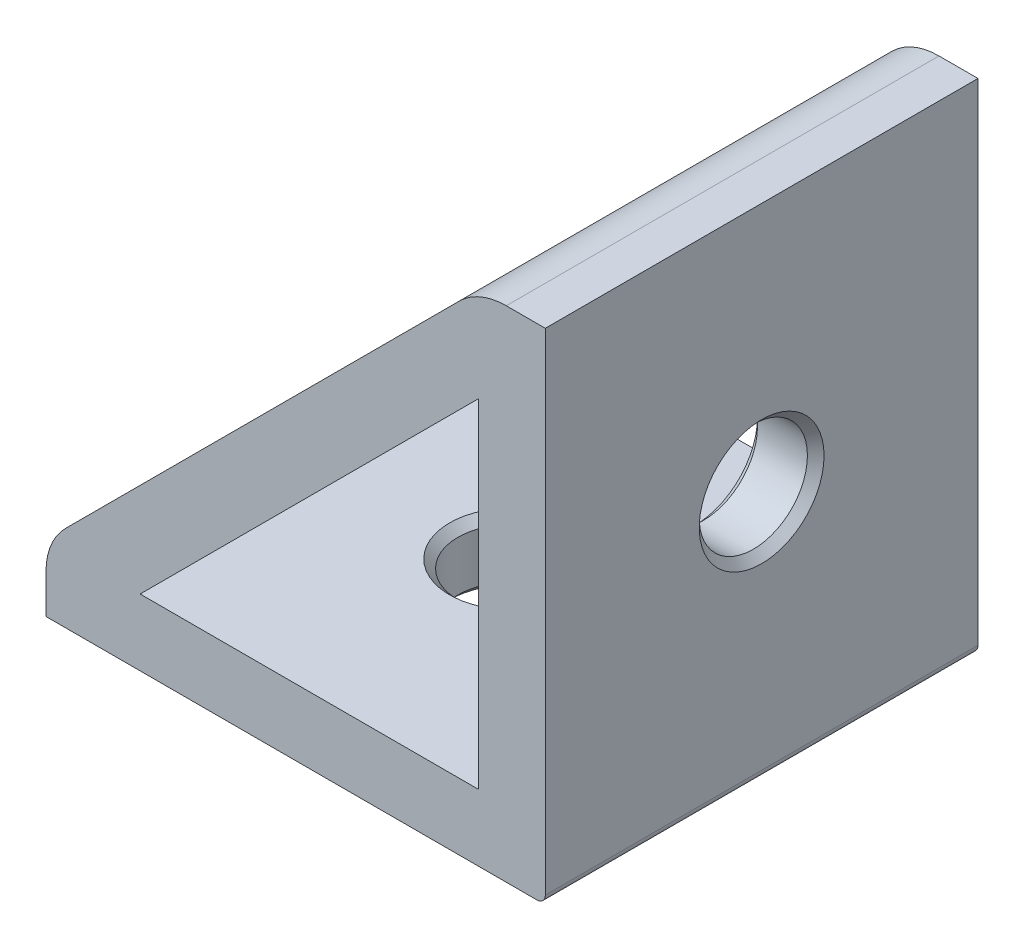
ISO-10303-21;
HEADER;
FILE_DESCRIPTION(('STEP AP214'),'2;1');
FILE_NAME('part.step','',(''),(''),'','','');
FILE_SCHEMA(('AUTOMOTIVE_DESIGN { 1 0 10303 214 1 1 1 1 }'));
ENDSEC;
DATA;
#1=APPLICATION_CONTEXT('core data for automotive mechanical design processes');
#2=APPLICATION_PROTOCOL_DEFINITION('international standard','automotive_design',2000,#1);
#3=PRODUCT_CONTEXT('',#1,'mechanical');
#4=PRODUCT('Part','Part','',(#3));
#5=PRODUCT_RELATED_PRODUCT_CATEGORY('part','',(#4));
#6=PRODUCT_DEFINITION_FORMATION('','',#4);
#7=PRODUCT_DEFINITION_CONTEXT('part definition',#1,'design');
#8=PRODUCT_DEFINITION('design','',#6,#7);
#9=PRODUCT_DEFINITION_SHAPE('','',#8);
#10=(LENGTH_UNIT() NAMED_UNIT(*) SI_UNIT(.MILLI.,.METRE.));
#11=(NAMED_UNIT(*) PLANE_ANGLE_UNIT() SI_UNIT($,.RADIAN.));
#12=(NAMED_UNIT(*) SI_UNIT($,.STERADIAN.) SOLID_ANGLE_UNIT());
#13=UNCERTAINTY_MEASURE_WITH_UNIT(LENGTH_MEASURE(1.E-05),#10,'distance_accuracy_value','');
#14=(GEOMETRIC_REPRESENTATION_CONTEXT(3) GLOBAL_UNCERTAINTY_ASSIGNED_CONTEXT((#13)) GLOBAL_UNIT_ASSIGNED_CONTEXT((#10,
#11,#12)) REPRESENTATION_CONTEXT('',''));
#15=CARTESIAN_POINT('',(0.,0.,0.));
#16=DIRECTION('',(0.,0.,1.));
#17=DIRECTION('',(1.,0.,0.));
#18=AXIS2_PLACEMENT_3D('',#15,#16,#17);
#19=CARTESIAN_POINT('',(-30.,0.,-26.));
#20=DIRECTION('',(0.,-1.,0.));
#21=DIRECTION('',(0.,0.,-1.));
#22=AXIS2_PLACEMENT_3D('',#19,#20,#21);
#23=PLANE('',#22);
#24=CARTESIAN_POINT('',(-15.,0.,-13.));
#25=DIRECTION('',(0.,-1.,0.));
#26=DIRECTION('',(0.,0.,-1.));
#27=AXIS2_PLACEMENT_3D('',#24,#25,#26);
#28=CIRCLE('',#27,3.74999999999999);
#29=CARTESIAN_POINT('',(-15.,0.,-16.75));
#30=VERTEX_POINT('',#29);
#31=EDGE_CURVE('E241',#30,#30,#28,.F.);
#32=ORIENTED_EDGE('',*,*,#31,.T.);
#33=EDGE_LOOP('',(#32));
#34=FACE_BOUND('',#33,.T.);
#35=DIRECTION('',(1.,0.,0.));
#36=VECTOR('',#35,1.);
#37=CARTESIAN_POINT('',(-30.,0.,-26.));
#38=LINE('',#37,#36);
#39=CARTESIAN_POINT('',(-30.,0.,-26.));
#40=VERTEX_POINT('',#39);
#41=CARTESIAN_POINT('',(-0.5,0.,-26.));
#42=VERTEX_POINT('',#41);
#43=EDGE_CURVE('E184',#40,#42,#38,.T.);
#44=ORIENTED_EDGE('',*,*,#43,.T.);
#45=DIRECTION('',(0.,0.,1.));
#46=VECTOR('',#45,1.);
#47=CARTESIAN_POINT('',(-0.5,0.,-26.));
#48=LINE('',#47,#46);
#49=CARTESIAN_POINT('',(-0.5,0.,0.));
#50=VERTEX_POINT('',#49);
#51=EDGE_CURVE('E303',#42,#50,#48,.T.);
#52=ORIENTED_EDGE('',*,*,#51,.T.);
#53=DIRECTION('',(1.,0.,0.));
#54=VECTOR('',#53,1.);
#55=CARTESIAN_POINT('',(-30.,0.,0.));
#56=LINE('',#55,#54);
#57=CARTESIAN_POINT('',(-30.,0.,0.));
#58=VERTEX_POINT('',#57);
#59=EDGE_CURVE('E182',#58,#50,#56,.T.);
#60=ORIENTED_EDGE('',*,*,#59,.F.);
#61=DIRECTION('',(0.,0.,1.));
#62=VECTOR('',#61,1.);
#63=CARTESIAN_POINT('',(-30.,0.,-26.));
#64=LINE('',#63,#62);
#65=EDGE_CURVE('E209',#40,#58,#64,.T.);
#66=ORIENTED_EDGE('',*,*,#65,.F.);
#67=EDGE_LOOP('',(#44,#52,#60,#66));
#68=FACE_BOUND('',#67,.T.);
#69=ADVANCED_FACE('F16',(#34,#68),#23,.T.);
#70=CARTESIAN_POINT('',(-30.,0.,-26.));
#71=DIRECTION('',(-1.,0.,0.));
#72=DIRECTION('',(0.,0.,1.));
#73=AXIS2_PLACEMENT_3D('',#70,#71,#72);
#74=PLANE('',#73);
#75=DIRECTION('',(0.,-1.,0.));
#76=VECTOR('',#75,1.);
#77=CARTESIAN_POINT('',(-30.,0.,0.));
#78=LINE('',#77,#76);
#79=CARTESIAN_POINT('',(-30.,2.34314575050762,0.));
#80=VERTEX_POINT('',#79);
#81=EDGE_CURVE('E188',#80,#58,#78,.T.);
#82=ORIENTED_EDGE('',*,*,#81,.F.);
#83=DIRECTION('',(0.,0.,1.));
#84=VECTOR('',#83,1.);
#85=CARTESIAN_POINT('',(-30.,2.34314575050762,-26.));
#86=LINE('',#85,#84);
#87=CARTESIAN_POINT('',(-30.,2.34314575050762,-26.));
#88=VERTEX_POINT('',#87);
#89=EDGE_CURVE('E230',#80,#88,#86,.F.);
#90=ORIENTED_EDGE('',*,*,#89,.T.);
#91=DIRECTION('',(0.,-1.,0.));
#92=VECTOR('',#91,1.);
#93=CARTESIAN_POINT('',(-30.,0.,-26.));
#94=LINE('',#93,#92);
#95=EDGE_CURVE('E196',#88,#40,#94,.T.);
#96=ORIENTED_EDGE('',*,*,#95,.T.);
#97=ORIENTED_EDGE('',*,*,#65,.T.);
#98=EDGE_LOOP('',(#82,#90,#96,#97));
#99=FACE_BOUND('',#98,.T.);
#100=ADVANCED_FACE('F326',(#99),#74,.T.);
#101=CARTESIAN_POINT('',(-30.,4.,-26.));
#102=DIRECTION('',(-0.707106781186548,0.707106781186548,0.));
#103=DIRECTION('',(-0.707106781186548,-0.707106781186548,0.));
#104=AXIS2_PLACEMENT_3D('',#101,#102,#103);
#105=PLANE('',#104);
#106=CARTESIAN_POINT('',(-14.8786796564404,19.1213203435596,-13.));
#107=DIRECTION('',(-0.707106781186548,0.707106781186548,0.));
#108=DIRECTION('',(-0.707106781186548,-0.707106781186548,0.));
#109=AXIS2_PLACEMENT_3D('',#106,#107,#108);
#110=CIRCLE('',#109,9.);
#111=CARTESIAN_POINT('',(-14.8786796564404,19.1213203435596,-22.));
#112=VERTEX_POINT('',#111);
#113=CARTESIAN_POINT('',(-14.8786796564404,19.1213203435596,-4.));
#114=VERTEX_POINT('',#113);
#115=EDGE_CURVE('E292',#112,#114,#110,.F.);
#116=ORIENTED_EDGE('',*,*,#115,.T.);
#117=DIRECTION('',(-0.707106781186548,-0.707106781186548,0.));
#118=VECTOR('',#117,1.);
#119=CARTESIAN_POINT('',(-19.1213203435596,14.8786796564404,-4.));
#120=LINE('',#119,#118);
#121=CARTESIAN_POINT('',(-19.1213203435596,14.8786796564404,-4.00000000000001));
#122=VERTEX_POINT('',#121);
#123=EDGE_CURVE('E294',#114,#122,#120,.T.);
#124=ORIENTED_EDGE('',*,*,#123,.T.);
#125=CARTESIAN_POINT('',(-19.1213203435596,14.8786796564404,-13.));
#126=DIRECTION('',(-0.707106781186548,0.707106781186548,0.));
#127=DIRECTION('',(-0.707106781186548,-0.707106781186548,0.));
#128=AXIS2_PLACEMENT_3D('',#125,#126,#127);
#129=CIRCLE('',#128,8.99999999999999);
#130=CARTESIAN_POINT('',(-19.1213203435596,14.8786796564404,-22.));
#131=VERTEX_POINT('',#130);
#132=EDGE_CURVE('E290',#122,#131,#129,.F.);
#133=ORIENTED_EDGE('',*,*,#132,.T.);
#134=DIRECTION('',(0.707106781186548,0.707106781186548,0.));
#135=VECTOR('',#134,1.);
#136=CARTESIAN_POINT('',(-14.8786796564403,19.1213203435596,-22.));
#137=LINE('',#136,#135);
#138=EDGE_CURVE('E288',#131,#112,#137,.T.);
#139=ORIENTED_EDGE('',*,*,#138,.T.);
#140=EDGE_LOOP('',(#116,#124,#133,#139));
#141=FACE_BOUND('',#140,.T.);
#142=DIRECTION('',(-0.707106781186547,-0.707106781186547,0.));
#143=VECTOR('',#142,1.);
#144=CARTESIAN_POINT('',(-30.,4.,0.));
#145=LINE('',#144,#143);
#146=CARTESIAN_POINT('',(-5.17157287525381,28.8284271247462,0.));
#147=VERTEX_POINT('',#146);
#148=CARTESIAN_POINT('',(-28.8284271247462,5.17157287525381,0.));
#149=VERTEX_POINT('',#148);
#150=EDGE_CURVE('E205',#147,#149,#145,.T.);
#151=ORIENTED_EDGE('',*,*,#150,.F.);
#152=DIRECTION('',(0.,0.,1.));
#153=VECTOR('',#152,1.);
#154=CARTESIAN_POINT('',(-5.17157287525381,28.8284271247462,-26.));
#155=LINE('',#154,#153);
#156=CARTESIAN_POINT('',(-5.17157287525381,28.8284271247462,-26.));
#157=VERTEX_POINT('',#156);
#158=EDGE_CURVE('E224',#147,#157,#155,.F.);
#159=ORIENTED_EDGE('',*,*,#158,.T.);
#160=DIRECTION('',(-0.707106781186547,-0.707106781186547,0.));
#161=VECTOR('',#160,1.);
#162=CARTESIAN_POINT('',(-30.,4.,-26.));
#163=LINE('',#162,#161);
#164=CARTESIAN_POINT('',(-28.8284271247462,5.17157287525381,-26.));
#165=VERTEX_POINT('',#164);
#166=EDGE_CURVE('E193',#157,#165,#163,.T.);
#167=ORIENTED_EDGE('',*,*,#166,.T.);
#168=DIRECTION('',(0.,0.,1.));
#169=VECTOR('',#168,1.);
#170=CARTESIAN_POINT('',(-28.8284271247462,5.17157287525381,-26.));
#171=LINE('',#170,#169);
#172=EDGE_CURVE('E221',#165,#149,#171,.T.);
#173=ORIENTED_EDGE('',*,*,#172,.T.);
#174=EDGE_LOOP('',(#151,#159,#167,#173));
#175=FACE_BOUND('',#174,.T.);
#176=ADVANCED_FACE('F345',(#141,#175),#105,.T.);
#177=CARTESIAN_POINT('',(0.,30.,-26.));
#178=DIRECTION('',(0.,1.,0.));
#179=DIRECTION('',(0.,0.,1.));
#180=AXIS2_PLACEMENT_3D('',#177,#178,#179);
#181=PLANE('',#180);
#182=DIRECTION('',(-1.,0.,0.));
#183=VECTOR('',#182,1.);
#184=CARTESIAN_POINT('',(0.,30.,-26.));
#185=LINE('',#184,#183);
#186=CARTESIAN_POINT('',(0.,30.,-26.));
#187=VERTEX_POINT('',#186);
#188=CARTESIAN_POINT('',(-2.34314575050762,30.,-26.));
#189=VERTEX_POINT('',#188);
#190=EDGE_CURVE('E190',#187,#189,#185,.T.);
#191=ORIENTED_EDGE('',*,*,#190,.T.);
#192=DIRECTION('',(0.,0.,1.));
#193=VECTOR('',#192,1.);
#194=CARTESIAN_POINT('',(-2.34314575050762,30.,-26.));
#195=LINE('',#194,#193);
#196=CARTESIAN_POINT('',(-2.34314575050762,30.,0.));
#197=VERTEX_POINT('',#196);
#198=EDGE_CURVE('E212',#189,#197,#195,.T.);
#199=ORIENTED_EDGE('',*,*,#198,.T.);
#200=DIRECTION('',(-1.,0.,0.));
#201=VECTOR('',#200,1.);
#202=CARTESIAN_POINT('',(0.,30.,0.));
#203=LINE('',#202,#201);
#204=CARTESIAN_POINT('',(0.,30.,0.));
#205=VERTEX_POINT('',#204);
#206=EDGE_CURVE('E202',#205,#197,#203,.T.);
#207=ORIENTED_EDGE('',*,*,#206,.F.);
#208=DIRECTION('',(0.,0.,1.));
#209=VECTOR('',#208,1.);
#210=CARTESIAN_POINT('',(0.,30.,-26.));
#211=LINE('',#210,#209);
#212=EDGE_CURVE('E198',#187,#205,#211,.T.);
#213=ORIENTED_EDGE('',*,*,#212,.F.);
#214=EDGE_LOOP('',(#191,#199,#207,#213));
#215=FACE_BOUND('',#214,.T.);
#216=ADVANCED_FACE('F502',(#215),#181,.T.);
#217=CARTESIAN_POINT('',(0.,0.,-26.));
#218=DIRECTION('',(1.,0.,0.));
#219=DIRECTION('',(0.,0.,-1.));
#220=AXIS2_PLACEMENT_3D('',#217,#218,#219);
#221=PLANE('',#220);
#222=CARTESIAN_POINT('',(0.,15.,-13.));
#223=DIRECTION('',(1.,0.,0.));
#224=DIRECTION('',(0.,0.,-1.));
#225=AXIS2_PLACEMENT_3D('',#222,#223,#224);
#226=CIRCLE('',#225,3.75);
#227=CARTESIAN_POINT('',(0.,15.,-16.75));
#228=VERTEX_POINT('',#227);
#229=EDGE_CURVE('E253',#228,#228,#226,.F.);
#230=ORIENTED_EDGE('',*,*,#229,.T.);
#231=EDGE_LOOP('',(#230));
#232=FACE_BOUND('',#231,.T.);
#233=DIRECTION('',(0.,1.,0.));
#234=VECTOR('',#233,1.);
#235=CARTESIAN_POINT('',(0.,0.,0.));
#236=LINE('',#235,#234);
#237=CARTESIAN_POINT('',(0.,0.5,0.));
#238=VERTEX_POINT('',#237);
#239=EDGE_CURVE('E200',#238,#205,#236,.T.);
#240=ORIENTED_EDGE('',*,*,#239,.F.);
#241=DIRECTION('',(0.,0.,1.));
#242=VECTOR('',#241,1.);
#243=CARTESIAN_POINT('',(0.,0.5,-26.));
#244=LINE('',#243,#242);
#245=CARTESIAN_POINT('',(0.,0.5,-26.));
#246=VERTEX_POINT('',#245);
#247=EDGE_CURVE('E24',#238,#246,#244,.F.);
#248=ORIENTED_EDGE('',*,*,#247,.T.);
#249=DIRECTION('',(0.,1.,0.));
#250=VECTOR('',#249,1.);
#251=CARTESIAN_POINT('',(0.,0.,-26.));
#252=LINE('',#251,#250);
#253=EDGE_CURVE('E187',#246,#187,#252,.T.);
#254=ORIENTED_EDGE('',*,*,#253,.T.);
#255=ORIENTED_EDGE('',*,*,#212,.T.);
#256=EDGE_LOOP('',(#240,#248,#254,#255));
#257=FACE_BOUND('',#256,.T.);
#258=ADVANCED_FACE('F349',(#232,#257),#221,.T.);
#259=CARTESIAN_POINT('',(0.,0.,-26.));
#260=DIRECTION('',(0.,0.,1.));
#261=DIRECTION('',(1.,0.,0.));
#262=AXIS2_PLACEMENT_3D('',#259,#260,#261);
#263=PLANE('',#262);
#264=DIRECTION('',(0.,1.,0.));
#265=VECTOR('',#264,1.);
#266=CARTESIAN_POINT('',(-4.,4.,-26.));
#267=LINE('',#266,#265);
#268=CARTESIAN_POINT('',(-4.,4.,-26.));
#269=VERTEX_POINT('',#268);
#270=CARTESIAN_POINT('',(-4.,24.3431457505076,-26.));
#271=VERTEX_POINT('',#270);
#272=EDGE_CURVE('E157',#269,#271,#267,.T.);
#273=ORIENTED_EDGE('',*,*,#272,.T.);
#274=DIRECTION('',(-0.707106781186547,-0.707106781186548,0.));
#275=VECTOR('',#274,1.);
#276=CARTESIAN_POINT('',(-4.,24.3431457505076,-26.));
#277=LINE('',#276,#275);
#278=CARTESIAN_POINT('',(-24.3431457505076,4.,-26.));
#279=VERTEX_POINT('',#278);
#280=EDGE_CURVE('E149',#271,#279,#277,.T.);
#281=ORIENTED_EDGE('',*,*,#280,.T.);
#282=DIRECTION('',(1.,0.,0.));
#283=VECTOR('',#282,1.);
#284=CARTESIAN_POINT('',(-24.3431457505076,4.,-26.));
#285=LINE('',#284,#283);
#286=EDGE_CURVE('E161',#279,#269,#285,.T.);
#287=ORIENTED_EDGE('',*,*,#286,.T.);
#288=EDGE_LOOP('',(#273,#281,#287));
#289=FACE_BOUND('',#288,.T.);
#290=ORIENTED_EDGE('',*,*,#253,.F.);
#291=CARTESIAN_POINT('',(-0.5,0.5,-26.));
#292=DIRECTION('',(0.,0.,1.));
#293=DIRECTION('',(1.,0.,0.));
#294=AXIS2_PLACEMENT_3D('',#291,#292,#293);
#295=CIRCLE('',#294,0.5);
#296=EDGE_CURVE('E10',#246,#42,#295,.F.);
#297=ORIENTED_EDGE('',*,*,#296,.T.);
#298=ORIENTED_EDGE('',*,*,#43,.F.);
#299=ORIENTED_EDGE('',*,*,#95,.F.);
#300=CARTESIAN_POINT('',(-26.,2.34314575050762,-26.));
#301=DIRECTION('',(0.,0.,1.));
#302=DIRECTION('',(1.,0.,0.));
#303=AXIS2_PLACEMENT_3D('',#300,#301,#302);
#304=CIRCLE('',#303,4.);
#305=EDGE_CURVE('E226',#88,#165,#304,.F.);
#306=ORIENTED_EDGE('',*,*,#305,.T.);
#307=ORIENTED_EDGE('',*,*,#166,.F.);
#308=CARTESIAN_POINT('',(-2.34314575050762,26.,-26.));
#309=DIRECTION('',(0.,0.,1.));
#310=DIRECTION('',(1.,0.,0.));
#311=AXIS2_PLACEMENT_3D('',#308,#309,#310);
#312=CIRCLE('',#311,4.);
#313=EDGE_CURVE('E228',#157,#189,#312,.F.);
#314=ORIENTED_EDGE('',*,*,#313,.T.);
#315=ORIENTED_EDGE('',*,*,#190,.F.);
#316=EDGE_LOOP('',(#290,#297,#298,#299,#306,#307,#314,#315));
#317=FACE_BOUND('',#316,.T.);
#318=ADVANCED_FACE('F165',(#289,#317),#263,.F.);
#319=CARTESIAN_POINT('',(0.,0.,0.));
#320=DIRECTION('',(0.,0.,1.));
#321=DIRECTION('',(1.,0.,0.));
#322=AXIS2_PLACEMENT_3D('',#319,#320,#321);
#323=PLANE('',#322);
#324=DIRECTION('',(-0.707106781186547,-0.707106781186548,0.));
#325=VECTOR('',#324,1.);
#326=CARTESIAN_POINT('',(-4.,24.3431457505076,0.));
#327=LINE('',#326,#325);
#328=CARTESIAN_POINT('',(-4.,24.3431457505076,0.));
#329=VERTEX_POINT('',#328);
#330=CARTESIAN_POINT('',(-24.3431457505076,4.,0.));
#331=VERTEX_POINT('',#330);
#332=EDGE_CURVE('E152',#329,#331,#327,.T.);
#333=ORIENTED_EDGE('',*,*,#332,.F.);
#334=DIRECTION('',(0.,1.,0.));
#335=VECTOR('',#334,1.);
#336=CARTESIAN_POINT('',(-4.,4.,0.));
#337=LINE('',#336,#335);
#338=CARTESIAN_POINT('',(-4.,4.,0.));
#339=VERTEX_POINT('',#338);
#340=EDGE_CURVE('E167',#339,#329,#337,.T.);
#341=ORIENTED_EDGE('',*,*,#340,.F.);
#342=DIRECTION('',(1.,0.,0.));
#343=VECTOR('',#342,1.);
#344=CARTESIAN_POINT('',(-24.3431457505076,4.,0.));
#345=LINE('',#344,#343);
#346=EDGE_CURVE('E170',#331,#339,#345,.T.);
#347=ORIENTED_EDGE('',*,*,#346,.F.);
#348=EDGE_LOOP('',(#333,#341,#347));
#349=FACE_BOUND('',#348,.T.);
#350=ORIENTED_EDGE('',*,*,#59,.T.);
#351=CARTESIAN_POINT('',(-0.5,0.5,0.));
#352=DIRECTION('',(0.,0.,1.));
#353=DIRECTION('',(1.,0.,0.));
#354=AXIS2_PLACEMENT_3D('',#351,#352,#353);
#355=CIRCLE('',#354,0.5);
#356=EDGE_CURVE('E38',#50,#238,#355,.T.);
#357=ORIENTED_EDGE('',*,*,#356,.T.);
#358=ORIENTED_EDGE('',*,*,#239,.T.);
#359=ORIENTED_EDGE('',*,*,#206,.T.);
#360=CARTESIAN_POINT('',(-2.34314575050762,26.,0.));
#361=DIRECTION('',(0.,0.,1.));
#362=DIRECTION('',(1.,0.,0.));
#363=AXIS2_PLACEMENT_3D('',#360,#361,#362);
#364=CIRCLE('',#363,4.);
#365=EDGE_CURVE('E219',#197,#147,#364,.T.);
#366=ORIENTED_EDGE('',*,*,#365,.T.);
#367=ORIENTED_EDGE('',*,*,#150,.T.);
#368=CARTESIAN_POINT('',(-26.,2.34314575050762,0.));
#369=DIRECTION('',(0.,0.,1.));
#370=DIRECTION('',(1.,0.,0.));
#371=AXIS2_PLACEMENT_3D('',#368,#369,#370);
#372=CIRCLE('',#371,4.);
#373=EDGE_CURVE('E217',#149,#80,#372,.T.);
#374=ORIENTED_EDGE('',*,*,#373,.T.);
#375=ORIENTED_EDGE('',*,*,#81,.T.);
#376=EDGE_LOOP('',(#350,#357,#358,#359,#366,#367,#374,#375));
#377=FACE_BOUND('',#376,.T.);
#378=ADVANCED_FACE('F322',(#349,#377),#323,.T.);
#379=CARTESIAN_POINT('',(-4.,24.3431457505076,-26.));
#380=DIRECTION('',(-0.707106781186548,0.707106781186547,0.));
#381=DIRECTION('',(-0.707106781186547,-0.707106781186548,0.));
#382=AXIS2_PLACEMENT_3D('',#379,#380,#381);
#383=PLANE('',#382);
#384=DIRECTION('',(0.707106781186547,0.707106781186548,0.));
#385=VECTOR('',#384,1.);
#386=CARTESIAN_POINT('',(-4.,24.3431457505076,-5.49999999999998));
#387=LINE('',#386,#385);
#388=CARTESIAN_POINT('',(-16.2928932188135,12.0502525316942,-5.49999999999998));
#389=VERTEX_POINT('',#388);
#390=CARTESIAN_POINT('',(-12.0502525316942,16.2928932188135,-5.49999999999998));
#391=VERTEX_POINT('',#390);
#392=EDGE_CURVE('E263',#389,#391,#387,.T.);
#393=ORIENTED_EDGE('',*,*,#392,.T.);
#394=CARTESIAN_POINT('',(-12.0502525316942,16.2928932188135,-13.));
#395=DIRECTION('',(-0.707106781186548,0.707106781186547,0.));
#396=DIRECTION('',(-0.707106781186547,-0.707106781186548,0.));
#397=AXIS2_PLACEMENT_3D('',#394,#395,#396);
#398=CIRCLE('',#397,7.50000000000002);
#399=CARTESIAN_POINT('',(-12.0502525316942,16.2928932188135,-20.5));
#400=VERTEX_POINT('',#399);
#401=EDGE_CURVE('E265',#391,#400,#398,.T.);
#402=ORIENTED_EDGE('',*,*,#401,.T.);
#403=DIRECTION('',(-0.707106781186547,-0.707106781186548,0.));
#404=VECTOR('',#403,1.);
#405=CARTESIAN_POINT('',(-4.,24.3431457505076,-20.5));
#406=LINE('',#405,#404);
#407=CARTESIAN_POINT('',(-16.2928932188135,12.0502525316942,-20.5));
#408=VERTEX_POINT('',#407);
#409=EDGE_CURVE('E261',#400,#408,#406,.T.);
#410=ORIENTED_EDGE('',*,*,#409,.T.);
#411=CARTESIAN_POINT('',(-16.2928932188135,12.0502525316942,-13.));
#412=DIRECTION('',(-0.707106781186548,0.707106781186547,0.));
#413=DIRECTION('',(-0.707106781186547,-0.707106781186548,0.));
#414=AXIS2_PLACEMENT_3D('',#411,#412,#413);
#415=CIRCLE('',#414,7.50000000000002);
#416=EDGE_CURVE('E259',#408,#389,#415,.T.);
#417=ORIENTED_EDGE('',*,*,#416,.T.);
#418=EDGE_LOOP('',(#393,#402,#410,#417));
#419=FACE_BOUND('',#418,.T.);
#420=ORIENTED_EDGE('',*,*,#332,.T.);
#421=DIRECTION('',(0.,0.,1.));
#422=VECTOR('',#421,1.);
#423=CARTESIAN_POINT('',(-24.3431457505076,4.,-26.));
#424=LINE('',#423,#422);
#425=EDGE_CURVE('E145',#279,#331,#424,.T.);
#426=ORIENTED_EDGE('',*,*,#425,.F.);
#427=ORIENTED_EDGE('',*,*,#280,.F.);
#428=DIRECTION('',(0.,0.,1.));
#429=VECTOR('',#428,1.);
#430=CARTESIAN_POINT('',(-4.,24.3431457505076,-26.));
#431=LINE('',#430,#429);
#432=EDGE_CURVE('E180',#271,#329,#431,.T.);
#433=ORIENTED_EDGE('',*,*,#432,.T.);
#434=EDGE_LOOP('',(#420,#426,#427,#433));
#435=FACE_BOUND('',#434,.T.);
#436=ADVANCED_FACE('F147',(#419,#435),#383,.F.);
#437=CARTESIAN_POINT('',(-4.,4.,-26.));
#438=DIRECTION('',(1.,0.,0.));
#439=DIRECTION('',(0.,0.,-1.));
#440=AXIS2_PLACEMENT_3D('',#437,#438,#439);
#441=PLANE('',#440);
#442=CARTESIAN_POINT('',(-4.,15.,-13.));
#443=DIRECTION('',(1.,0.,0.));
#444=DIRECTION('',(0.,0.,-1.));
#445=AXIS2_PLACEMENT_3D('',#442,#443,#444);
#446=CIRCLE('',#445,3.75);
#447=CARTESIAN_POINT('',(-4.,15.,-16.75));
#448=VERTEX_POINT('',#447);
#449=EDGE_CURVE('E244',#448,#448,#446,.T.);
#450=ORIENTED_EDGE('',*,*,#449,.T.);
#451=EDGE_LOOP('',(#450));
#452=FACE_BOUND('',#451,.T.);
#453=ORIENTED_EDGE('',*,*,#340,.T.);
#454=ORIENTED_EDGE('',*,*,#432,.F.);
#455=ORIENTED_EDGE('',*,*,#272,.F.);
#456=DIRECTION('',(0.,0.,1.));
#457=VECTOR('',#456,1.);
#458=CARTESIAN_POINT('',(-4.,4.,-26.));
#459=LINE('',#458,#457);
#460=EDGE_CURVE('E156',#269,#339,#459,.T.);
#461=ORIENTED_EDGE('',*,*,#460,.T.);
#462=EDGE_LOOP('',(#453,#454,#455,#461));
#463=FACE_BOUND('',#462,.T.);
#464=ADVANCED_FACE('F487',(#452,#463),#441,.F.);
#465=CARTESIAN_POINT('',(-24.3431457505076,4.,-26.));
#466=DIRECTION('',(0.,-1.,0.));
#467=DIRECTION('',(0.,0.,-1.));
#468=AXIS2_PLACEMENT_3D('',#465,#466,#467);
#469=PLANE('',#468);
#470=CARTESIAN_POINT('',(-15.,4.,-13.));
#471=DIRECTION('',(0.,-1.,0.));
#472=DIRECTION('',(0.,0.,-1.));
#473=AXIS2_PLACEMENT_3D('',#470,#471,#472);
#474=CIRCLE('',#473,3.75000000000002);
#475=CARTESIAN_POINT('',(-15.,4.,-16.75));
#476=VERTEX_POINT('',#475);
#477=EDGE_CURVE('E238',#476,#476,#474,.T.);
#478=ORIENTED_EDGE('',*,*,#477,.T.);
#479=EDGE_LOOP('',(#478));
#480=FACE_BOUND('',#479,.T.);
#481=ORIENTED_EDGE('',*,*,#346,.T.);
#482=ORIENTED_EDGE('',*,*,#460,.F.);
#483=ORIENTED_EDGE('',*,*,#286,.F.);
#484=ORIENTED_EDGE('',*,*,#425,.T.);
#485=EDGE_LOOP('',(#481,#482,#483,#484));
#486=FACE_BOUND('',#485,.T.);
#487=ADVANCED_FACE('F162',(#480,#486),#469,.F.);
#488=CARTESIAN_POINT('',(-6.,15.,-13.));
#489=DIRECTION('',(1.,0.,0.));
#490=DIRECTION('',(0.,0.,-1.));
#491=AXIS2_PLACEMENT_3D('',#488,#489,#490);
#492=CYLINDRICAL_SURFACE('',#491,3.25);
#493=CARTESIAN_POINT('',(-3.5,15.,-13.));
#494=DIRECTION('',(1.,0.,0.));
#495=DIRECTION('',(0.,0.,-1.));
#496=AXIS2_PLACEMENT_3D('',#493,#494,#495);
#497=CIRCLE('',#496,3.25);
#498=CARTESIAN_POINT('',(-3.5,15.,-16.25));
#499=VERTEX_POINT('',#498);
#500=EDGE_CURVE('E250',#499,#499,#497,.F.);
#501=ORIENTED_EDGE('',*,*,#500,.T.);
#502=EDGE_LOOP('',(#501));
#503=FACE_BOUND('',#502,.T.);
#504=CARTESIAN_POINT('',(-0.499999999999996,15.,-13.));
#505=DIRECTION('',(1.,0.,0.));
#506=DIRECTION('',(0.,0.,-1.));
#507=AXIS2_PLACEMENT_3D('',#504,#505,#506);
#508=CIRCLE('',#507,3.25);
#509=CARTESIAN_POINT('',(-0.499999999999996,15.,-16.25));
#510=VERTEX_POINT('',#509);
#511=EDGE_CURVE('E247',#510,#510,#508,.T.);
#512=ORIENTED_EDGE('',*,*,#511,.T.);
#513=EDGE_LOOP('',(#512));
#514=FACE_BOUND('',#513,.T.);
#515=ADVANCED_FACE('F523',(#503,#514),#492,.F.);
#516=CARTESIAN_POINT('',(-15.,5.99999999999999,-13.));
#517=DIRECTION('',(0.,-1.,0.));
#518=DIRECTION('',(1.,0.,0.));
#519=AXIS2_PLACEMENT_3D('',#516,#517,#518);
#520=CYLINDRICAL_SURFACE('',#519,3.25);
#521=CARTESIAN_POINT('',(-15.,3.49999999999999,-13.));
#522=DIRECTION('',(0.,-1.,0.));
#523=DIRECTION('',(0.,0.,-1.));
#524=AXIS2_PLACEMENT_3D('',#521,#522,#523);
#525=CIRCLE('',#524,3.25);
#526=CARTESIAN_POINT('',(-15.,3.49999999999999,-16.25));
#527=VERTEX_POINT('',#526);
#528=EDGE_CURVE('E235',#527,#527,#525,.F.);
#529=ORIENTED_EDGE('',*,*,#528,.T.);
#530=EDGE_LOOP('',(#529));
#531=FACE_BOUND('',#530,.T.);
#532=CARTESIAN_POINT('',(-15.,0.499999999999987,-13.));
#533=DIRECTION('',(0.,-1.,0.));
#534=DIRECTION('',(0.,0.,-1.));
#535=AXIS2_PLACEMENT_3D('',#532,#533,#534);
#536=CIRCLE('',#535,3.25);
#537=CARTESIAN_POINT('',(-15.,0.499999999999987,-16.25));
#538=VERTEX_POINT('',#537);
#539=EDGE_CURVE('E232',#538,#538,#536,.T.);
#540=ORIENTED_EDGE('',*,*,#539,.T.);
#541=EDGE_LOOP('',(#540));
#542=FACE_BOUND('',#541,.T.);
#543=ADVANCED_FACE('F525',(#531,#542),#520,.F.);
#544=CARTESIAN_POINT('',(5.2124239699379,-0.969783282818611,-13.));
#545=DIRECTION('',(-0.707106781186548,0.707106781186547,0.));
#546=DIRECTION('',(-0.707106781186547,-0.707106781186548,0.));
#547=AXIS2_PLACEMENT_3D('',#544,#545,#546);
#548=CYLINDRICAL_SURFACE('',#547,7.);
#549=DIRECTION('',(-0.707106781186548,0.707106781186547,0.));
#550=VECTOR('',#549,1.);
#551=CARTESIAN_POINT('',(5.2124239699379,-0.969783282818611,-6.));
#552=LINE('',#551,#550);
#553=CARTESIAN_POINT('',(-12.4038059222875,16.6464466094067,-6.));
#554=VERTEX_POINT('',#553);
#555=CARTESIAN_POINT('',(-13.4644660940673,17.7071067811866,-6.));
#556=VERTEX_POINT('',#555);
#557=EDGE_CURVE('E178',#554,#556,#552,.T.);
#558=ORIENTED_EDGE('',*,*,#557,.T.);
#559=CARTESIAN_POINT('',(-13.4644660940673,17.7071067811866,-13.));
#560=DIRECTION('',(-0.707106781186548,0.707106781186548,0.));
#561=DIRECTION('',(-0.707106781186548,-0.707106781186548,0.));
#562=AXIS2_PLACEMENT_3D('',#559,#560,#561);
#563=CIRCLE('',#562,7.);
#564=CARTESIAN_POINT('',(-13.4644660940673,17.7071067811866,-20.));
#565=VERTEX_POINT('',#564);
#566=EDGE_CURVE('E297',#556,#565,#563,.T.);
#567=ORIENTED_EDGE('',*,*,#566,.T.);
#568=DIRECTION('',(-0.707106781186548,0.707106781186547,0.));
#569=VECTOR('',#568,1.);
#570=CARTESIAN_POINT('',(5.2124239699379,-0.969783282818607,-20.));
#571=LINE('',#570,#569);
#572=CARTESIAN_POINT('',(-12.4038059222875,16.6464466094067,-20.));
#573=VERTEX_POINT('',#572);
#574=EDGE_CURVE('E173',#573,#565,#571,.T.);
#575=ORIENTED_EDGE('',*,*,#574,.F.);
#576=CARTESIAN_POINT('',(-12.4038059222875,16.6464466094067,-13.));
#577=DIRECTION('',(-0.707106781186548,0.707106781186548,0.));
#578=DIRECTION('',(-0.707106781186548,-0.707106781186548,0.));
#579=AXIS2_PLACEMENT_3D('',#576,#577,#578);
#580=CIRCLE('',#579,7.);
#581=EDGE_CURVE('E256',#573,#554,#580,.F.);
#582=ORIENTED_EDGE('',*,*,#581,.T.);
#583=EDGE_LOOP('',(#558,#567,#575,#582));
#584=FACE_BOUND('',#583,.T.);
#585=ADVANCED_FACE('F476',(#584),#548,.F.);
#586=CARTESIAN_POINT('',(5.2124239699379,-0.969783282818611,-6.));
#587=DIRECTION('',(0.,0.,1.));
#588=DIRECTION('',(1.,0.,0.));
#589=AXIS2_PLACEMENT_3D('',#586,#587,#588);
#590=PLANE('',#589);
#591=DIRECTION('',(-0.707106781186548,0.707106781186547,0.));
#592=VECTOR('',#591,1.);
#593=CARTESIAN_POINT('',(0.969783282818618,-5.21242396993789,-6.));
#594=LINE('',#593,#592);
#595=CARTESIAN_POINT('',(-16.6464466094067,12.4038059222875,-6.));
#596=VERTEX_POINT('',#595);
#597=CARTESIAN_POINT('',(-17.7071067811865,13.4644660940673,-6.));
#598=VERTEX_POINT('',#597);
#599=EDGE_CURVE('E459',#596,#598,#594,.T.);
#600=ORIENTED_EDGE('',*,*,#599,.T.);
#601=DIRECTION('',(0.707106781186548,0.707106781186548,0.));
#602=VECTOR('',#601,1.);
#603=CARTESIAN_POINT('',(-13.4644660940673,17.7071067811866,-6.));
#604=LINE('',#603,#602);
#605=EDGE_CURVE('E274',#598,#556,#604,.T.);
#606=ORIENTED_EDGE('',*,*,#605,.T.);
#607=ORIENTED_EDGE('',*,*,#557,.F.);
#608=DIRECTION('',(-0.707106781186547,-0.707106781186548,0.));
#609=VECTOR('',#608,1.);
#610=CARTESIAN_POINT('',(-12.4038059222875,16.6464466094067,-6.));
#611=LINE('',#610,#609);
#612=EDGE_CURVE('E268',#554,#596,#611,.T.);
#613=ORIENTED_EDGE('',*,*,#612,.T.);
#614=EDGE_LOOP('',(#600,#606,#607,#613));
#615=FACE_BOUND('',#614,.T.);
#616=ADVANCED_FACE('F464',(#615),#590,.F.);
#617=CARTESIAN_POINT('',(0.969783282818618,-5.2124239699379,-13.));
#618=DIRECTION('',(-0.707106781186548,0.707106781186547,0.));
#619=DIRECTION('',(-0.707106781186547,-0.707106781186548,0.));
#620=AXIS2_PLACEMENT_3D('',#617,#618,#619);
#621=CYLINDRICAL_SURFACE('',#620,7.);
#622=DIRECTION('',(-0.707106781186548,0.707106781186547,0.));
#623=VECTOR('',#622,1.);
#624=CARTESIAN_POINT('',(0.969783282818618,-5.21242396993789,-20.));
#625=LINE('',#624,#623);
#626=CARTESIAN_POINT('',(-16.6464466094067,12.4038059222875,-20.));
#627=VERTEX_POINT('',#626);
#628=CARTESIAN_POINT('',(-17.7071067811865,13.4644660940673,-20.));
#629=VERTEX_POINT('',#628);
#630=EDGE_CURVE('E462',#627,#629,#625,.T.);
#631=ORIENTED_EDGE('',*,*,#630,.T.);
#632=CARTESIAN_POINT('',(-17.7071067811866,13.4644660940673,-13.));
#633=DIRECTION('',(-0.707106781186547,0.707106781186547,0.));
#634=DIRECTION('',(-0.707106781186548,-0.707106781186548,0.));
#635=AXIS2_PLACEMENT_3D('',#632,#633,#634);
#636=CIRCLE('',#635,7.);
#637=EDGE_CURVE('E299',#629,#598,#636,.T.);
#638=ORIENTED_EDGE('',*,*,#637,.T.);
#639=ORIENTED_EDGE('',*,*,#599,.F.);
#640=CARTESIAN_POINT('',(-16.6464466094067,12.4038059222875,-13.));
#641=DIRECTION('',(-0.707106781186548,0.707106781186548,0.));
#642=DIRECTION('',(-0.707106781186548,-0.707106781186548,0.));
#643=AXIS2_PLACEMENT_3D('',#640,#641,#642);
#644=CIRCLE('',#643,7.);
#645=EDGE_CURVE('E272',#596,#627,#644,.F.);
#646=ORIENTED_EDGE('',*,*,#645,.T.);
#647=EDGE_LOOP('',(#631,#638,#639,#646));
#648=FACE_BOUND('',#647,.T.);
#649=ADVANCED_FACE('F458',(#648),#621,.F.);
#650=CARTESIAN_POINT('',(5.2124239699379,-0.969783282818607,-20.));
#651=DIRECTION('',(0.,0.,-1.));
#652=DIRECTION('',(-1.,0.,0.));
#653=AXIS2_PLACEMENT_3D('',#650,#651,#652);
#654=PLANE('',#653);
#655=ORIENTED_EDGE('',*,*,#574,.T.);
#656=DIRECTION('',(-0.707106781186548,-0.707106781186548,0.));
#657=VECTOR('',#656,1.);
#658=CARTESIAN_POINT('',(-17.7071067811866,13.4644660940673,-20.));
#659=LINE('',#658,#657);
#660=EDGE_CURVE('E301',#565,#629,#659,.T.);
#661=ORIENTED_EDGE('',*,*,#660,.T.);
#662=ORIENTED_EDGE('',*,*,#630,.F.);
#663=DIRECTION('',(0.707106781186547,0.707106781186548,0.));
#664=VECTOR('',#663,1.);
#665=CARTESIAN_POINT('',(-12.4038059222875,16.6464466094067,-20.));
#666=LINE('',#665,#664);
#667=EDGE_CURVE('E270',#627,#573,#666,.T.);
#668=ORIENTED_EDGE('',*,*,#667,.T.);
#669=EDGE_LOOP('',(#655,#661,#662,#668));
#670=FACE_BOUND('',#669,.T.);
#671=ADVANCED_FACE('F355',(#670),#654,.F.);
#672=CARTESIAN_POINT('',(-2.34314575050762,26.,-26.));
#673=DIRECTION('',(0.,0.,1.));
#674=DIRECTION('',(1.,0.,0.));
#675=AXIS2_PLACEMENT_3D('',#672,#673,#674);
#676=CYLINDRICAL_SURFACE('',#675,4.);
#677=ORIENTED_EDGE('',*,*,#313,.F.);
#678=ORIENTED_EDGE('',*,*,#158,.F.);
#679=ORIENTED_EDGE('',*,*,#365,.F.);
#680=ORIENTED_EDGE('',*,*,#198,.F.);
#681=EDGE_LOOP('',(#677,#678,#679,#680));
#682=FACE_BOUND('',#681,.T.);
#683=ADVANCED_FACE('F351',(#682),#676,.T.);
#684=CARTESIAN_POINT('',(-26.,2.34314575050762,-26.));
#685=DIRECTION('',(0.,0.,1.));
#686=DIRECTION('',(1.,0.,0.));
#687=AXIS2_PLACEMENT_3D('',#684,#685,#686);
#688=CYLINDRICAL_SURFACE('',#687,4.);
#689=ORIENTED_EDGE('',*,*,#305,.F.);
#690=ORIENTED_EDGE('',*,*,#89,.F.);
#691=ORIENTED_EDGE('',*,*,#373,.F.);
#692=ORIENTED_EDGE('',*,*,#172,.F.);
#693=EDGE_LOOP('',(#689,#690,#691,#692));
#694=FACE_BOUND('',#693,.T.);
#695=ADVANCED_FACE('F354',(#694),#688,.T.);
#696=CARTESIAN_POINT('',(-15.,3.49999999999999,-13.));
#697=DIRECTION('',(0.,1.,0.));
#698=DIRECTION('',(0.,0.,1.));
#699=AXIS2_PLACEMENT_3D('',#696,#697,#698);
#700=CONICAL_SURFACE('',#699,3.25,0.785398163397451);
#701=ORIENTED_EDGE('',*,*,#477,.F.);
#702=EDGE_LOOP('',(#701));
#703=FACE_BOUND('',#702,.T.);
#704=ORIENTED_EDGE('',*,*,#528,.F.);
#705=EDGE_LOOP('',(#704));
#706=FACE_BOUND('',#705,.T.);
#707=ADVANCED_FACE('F359',(#703,#706),#700,.F.);
#708=CARTESIAN_POINT('',(-15.,0.,-13.));
#709=DIRECTION('',(0.,-1.,0.));
#710=DIRECTION('',(0.,0.,-1.));
#711=AXIS2_PLACEMENT_3D('',#708,#709,#710);
#712=CONICAL_SURFACE('',#711,3.74999999999999,0.78539816339745);
#713=ORIENTED_EDGE('',*,*,#539,.F.);
#714=EDGE_LOOP('',(#713));
#715=FACE_BOUND('',#714,.T.);
#716=ORIENTED_EDGE('',*,*,#31,.F.);
#717=EDGE_LOOP('',(#716));
#718=FACE_BOUND('',#717,.T.);
#719=ADVANCED_FACE('F368',(#715,#718),#712,.F.);
#720=CARTESIAN_POINT('',(-4.,15.,-13.));
#721=DIRECTION('',(-1.,0.,0.));
#722=DIRECTION('',(0.,0.,1.));
#723=AXIS2_PLACEMENT_3D('',#720,#721,#722);
#724=CONICAL_SURFACE('',#723,3.75,0.785398163397446);
#725=ORIENTED_EDGE('',*,*,#500,.F.);
#726=EDGE_LOOP('',(#725));
#727=FACE_BOUND('',#726,.T.);
#728=ORIENTED_EDGE('',*,*,#449,.F.);
#729=EDGE_LOOP('',(#728));
#730=FACE_BOUND('',#729,.T.);
#731=ADVANCED_FACE('F375',(#727,#730),#724,.F.);
#732=CARTESIAN_POINT('',(-0.499999999999996,15.,-13.));
#733=DIRECTION('',(1.,0.,0.));
#734=DIRECTION('',(0.,0.,-1.));
#735=AXIS2_PLACEMENT_3D('',#732,#733,#734);
#736=CONICAL_SURFACE('',#735,3.25,0.785398163397451);
#737=ORIENTED_EDGE('',*,*,#229,.F.);
#738=EDGE_LOOP('',(#737));
#739=FACE_BOUND('',#738,.T.);
#740=ORIENTED_EDGE('',*,*,#511,.F.);
#741=EDGE_LOOP('',(#740));
#742=FACE_BOUND('',#741,.T.);
#743=ADVANCED_FACE('F382',(#739,#742),#736,.F.);
#744=CARTESIAN_POINT('',(-16.6464466094067,12.4038059222875,-13.));
#745=DIRECTION('',(0.707106781186548,-0.707106781186548,0.));
#746=DIRECTION('',(0.707106781186548,0.707106781186548,0.));
#747=AXIS2_PLACEMENT_3D('',#744,#745,#746);
#748=CONICAL_SURFACE('',#747,7.,0.785398163397452);
#749=DIRECTION('',(-0.499999999999997,0.499999999999997,-0.707106781186552));
#750=VECTOR('',#749,1.);
#751=CARTESIAN_POINT('',(-16.2928932188135,12.0502525316942,-5.49999999999998));
#752=LINE('',#751,#750);
#753=EDGE_CURVE('E280',#389,#596,#752,.T.);
#754=ORIENTED_EDGE('',*,*,#753,.F.);
#755=ORIENTED_EDGE('',*,*,#416,.F.);
#756=DIRECTION('',(0.499999999999998,-0.499999999999998,-0.707106781186551));
#757=VECTOR('',#756,1.);
#758=CARTESIAN_POINT('',(-16.6464466094067,12.4038059222875,-20.));
#759=LINE('',#758,#757);
#760=EDGE_CURVE('E283',#627,#408,#759,.T.);
#761=ORIENTED_EDGE('',*,*,#760,.F.);
#762=ORIENTED_EDGE('',*,*,#645,.F.);
#763=EDGE_LOOP('',(#754,#755,#761,#762));
#764=FACE_BOUND('',#763,.T.);
#765=ADVANCED_FACE('F389',(#764),#748,.F.);
#766=CARTESIAN_POINT('',(-12.4038059222875,16.6464466094067,-20.));
#767=DIRECTION('',(-0.5,0.5,-0.707106781186547));
#768=DIRECTION('',(0.707106781186547,0.707106781186548,0.));
#769=AXIS2_PLACEMENT_3D('',#766,#767,#768);
#770=PLANE('',#769);
#771=ORIENTED_EDGE('',*,*,#760,.T.);
#772=ORIENTED_EDGE('',*,*,#409,.F.);
#773=DIRECTION('',(0.500000000000002,-0.499999999999999,-0.707106781186547));
#774=VECTOR('',#773,1.);
#775=CARTESIAN_POINT('',(-12.4038059222875,16.6464466094067,-20.));
#776=LINE('',#775,#774);
#777=EDGE_CURVE('E277',#573,#400,#776,.T.);
#778=ORIENTED_EDGE('',*,*,#777,.F.);
#779=ORIENTED_EDGE('',*,*,#667,.F.);
#780=EDGE_LOOP('',(#771,#772,#778,#779));
#781=FACE_BOUND('',#780,.T.);
#782=ADVANCED_FACE('F407',(#781),#770,.F.);
#783=CARTESIAN_POINT('',(-12.4038059222875,16.6464466094067,-6.));
#784=DIRECTION('',(-0.5,0.5,0.707106781186547));
#785=DIRECTION('',(-0.707106781186547,-0.707106781186548,0.));
#786=AXIS2_PLACEMENT_3D('',#783,#784,#785);
#787=PLANE('',#786);
#788=ORIENTED_EDGE('',*,*,#753,.T.);
#789=ORIENTED_EDGE('',*,*,#612,.F.);
#790=DIRECTION('',(-0.500000000000004,0.499999999999996,-0.707106781186548));
#791=VECTOR('',#790,1.);
#792=CARTESIAN_POINT('',(-12.0502525316942,16.2928932188135,-5.49999999999998));
#793=LINE('',#792,#791);
#794=EDGE_CURVE('E275',#391,#554,#793,.T.);
#795=ORIENTED_EDGE('',*,*,#794,.F.);
#796=ORIENTED_EDGE('',*,*,#392,.F.);
#797=EDGE_LOOP('',(#788,#789,#795,#796));
#798=FACE_BOUND('',#797,.T.);
#799=ADVANCED_FACE('F400',(#798),#787,.F.);
#800=CARTESIAN_POINT('',(-12.4038059222875,16.6464466094067,-13.));
#801=DIRECTION('',(0.707106781186548,-0.707106781186548,0.));
#802=DIRECTION('',(0.707106781186548,0.707106781186548,0.));
#803=AXIS2_PLACEMENT_3D('',#800,#801,#802);
#804=CONICAL_SURFACE('',#803,7.,0.785398163397453);
#805=ORIENTED_EDGE('',*,*,#777,.T.);
#806=ORIENTED_EDGE('',*,*,#401,.F.);
#807=ORIENTED_EDGE('',*,*,#794,.T.);
#808=ORIENTED_EDGE('',*,*,#581,.F.);
#809=EDGE_LOOP('',(#805,#806,#807,#808));
#810=FACE_BOUND('',#809,.T.);
#811=ADVANCED_FACE('F392',(#810),#804,.F.);
#812=CARTESIAN_POINT('',(-13.4644660940673,17.7071067811866,-20.));
#813=DIRECTION('',(-0.5,0.5,0.707106781186547));
#814=DIRECTION('',(0.707106781186548,0.707106781186548,0.));
#815=AXIS2_PLACEMENT_3D('',#812,#813,#814);
#816=PLANE('',#815);
#817=DIRECTION('',(0.5,-0.5,0.707106781186548));
#818=VECTOR('',#817,1.);
#819=CARTESIAN_POINT('',(-14.8786796564404,19.1213203435596,-22.));
#820=LINE('',#819,#818);
#821=EDGE_CURVE('E308',#112,#565,#820,.T.);
#822=ORIENTED_EDGE('',*,*,#821,.F.);
#823=ORIENTED_EDGE('',*,*,#138,.F.);
#824=DIRECTION('',(-0.499999999999999,0.5,-0.707106781186548));
#825=VECTOR('',#824,1.);
#826=CARTESIAN_POINT('',(-17.7071067811866,13.4644660940673,-20.));
#827=LINE('',#826,#825);
#828=EDGE_CURVE('E278',#629,#131,#827,.T.);
#829=ORIENTED_EDGE('',*,*,#828,.F.);
#830=ORIENTED_EDGE('',*,*,#660,.F.);
#831=EDGE_LOOP('',(#822,#823,#829,#830));
#832=FACE_BOUND('',#831,.T.);
#833=ADVANCED_FACE('F399',(#832),#816,.T.);
#834=CARTESIAN_POINT('',(-17.7071067811866,13.4644660940673,-13.));
#835=DIRECTION('',(-0.707106781186547,0.707106781186547,0.));
#836=DIRECTION('',(-0.707106781186548,-0.707106781186548,0.));
#837=AXIS2_PLACEMENT_3D('',#834,#835,#836);
#838=CONICAL_SURFACE('',#837,7.,0.785398163397449);
#839=ORIENTED_EDGE('',*,*,#828,.T.);
#840=ORIENTED_EDGE('',*,*,#132,.F.);
#841=DIRECTION('',(-0.5,0.499999999999999,0.707106781186548));
#842=VECTOR('',#841,1.);
#843=CARTESIAN_POINT('',(-17.7071067811866,13.4644660940673,-6.));
#844=LINE('',#843,#842);
#845=EDGE_CURVE('E306',#598,#122,#844,.T.);
#846=ORIENTED_EDGE('',*,*,#845,.F.);
#847=ORIENTED_EDGE('',*,*,#637,.F.);
#848=EDGE_LOOP('',(#839,#840,#846,#847));
#849=FACE_BOUND('',#848,.T.);
#850=ADVANCED_FACE('F428',(#849),#838,.F.);
#851=CARTESIAN_POINT('',(-13.4644660940673,17.7071067811866,-13.));
#852=DIRECTION('',(-0.707106781186548,0.707106781186548,0.));
#853=DIRECTION('',(-0.707106781186548,-0.707106781186548,0.));
#854=AXIS2_PLACEMENT_3D('',#851,#852,#853);
#855=CONICAL_SURFACE('',#854,7.,0.78539816339745);
#856=ORIENTED_EDGE('',*,*,#821,.T.);
#857=ORIENTED_EDGE('',*,*,#566,.F.);
#858=DIRECTION('',(0.499999999999998,-0.5,-0.707106781186549));
#859=VECTOR('',#858,1.);
#860=CARTESIAN_POINT('',(-14.8786796564404,19.1213203435596,-4.));
#861=LINE('',#860,#859);
#862=EDGE_CURVE('E304',#114,#556,#861,.T.);
#863=ORIENTED_EDGE('',*,*,#862,.F.);
#864=ORIENTED_EDGE('',*,*,#115,.F.);
#865=EDGE_LOOP('',(#856,#857,#863,#864));
#866=FACE_BOUND('',#865,.T.);
#867=ADVANCED_FACE('F336',(#866),#855,.F.);
#868=CARTESIAN_POINT('',(-13.4644660940673,17.7071067811866,-6.));
#869=DIRECTION('',(-0.500000000000001,0.500000000000001,-0.707106781186547));
#870=DIRECTION('',(-0.707106781186548,-0.707106781186548,0.));
#871=AXIS2_PLACEMENT_3D('',#868,#869,#870);
#872=PLANE('',#871);
#873=ORIENTED_EDGE('',*,*,#845,.T.);
#874=ORIENTED_EDGE('',*,*,#123,.F.);
#875=ORIENTED_EDGE('',*,*,#862,.T.);
#876=ORIENTED_EDGE('',*,*,#605,.F.);
#877=EDGE_LOOP('',(#873,#874,#875,#876));
#878=FACE_BOUND('',#877,.T.);
#879=ADVANCED_FACE('F331',(#878),#872,.T.);
#880=CARTESIAN_POINT('',(-0.5,0.5,-26.));
#881=DIRECTION('',(0.,0.,1.));
#882=DIRECTION('',(1.,0.,0.));
#883=AXIS2_PLACEMENT_3D('',#880,#881,#882);
#884=CYLINDRICAL_SURFACE('',#883,0.5);
#885=ORIENTED_EDGE('',*,*,#296,.F.);
#886=ORIENTED_EDGE('',*,*,#247,.F.);
#887=ORIENTED_EDGE('',*,*,#356,.F.);
#888=ORIENTED_EDGE('',*,*,#51,.F.);
#889=EDGE_LOOP('',(#885,#886,#887,#888));
#890=FACE_BOUND('',#889,.T.);
#891=ADVANCED_FACE('F18',(#890),#884,.T.);
#892=CLOSED_SHELL('',(#69,#100,#176,#216,#258,#318,#378,#436,#464,#487,#515,#543,#585,#616,#649,
#671,#683,#695,#707,#719,#731,#743,#765,#782,#799,#811,#833,#850,#867,#879,#891));
#893=MANIFOLD_SOLID_BREP('B1',#892);
#894=ADVANCED_BREP_SHAPE_REPRESENTATION('',(#18,#893),#14);
#895=SHAPE_DEFINITION_REPRESENTATION(#9,#894);
ENDSEC;
END-ISO-10303-21;
